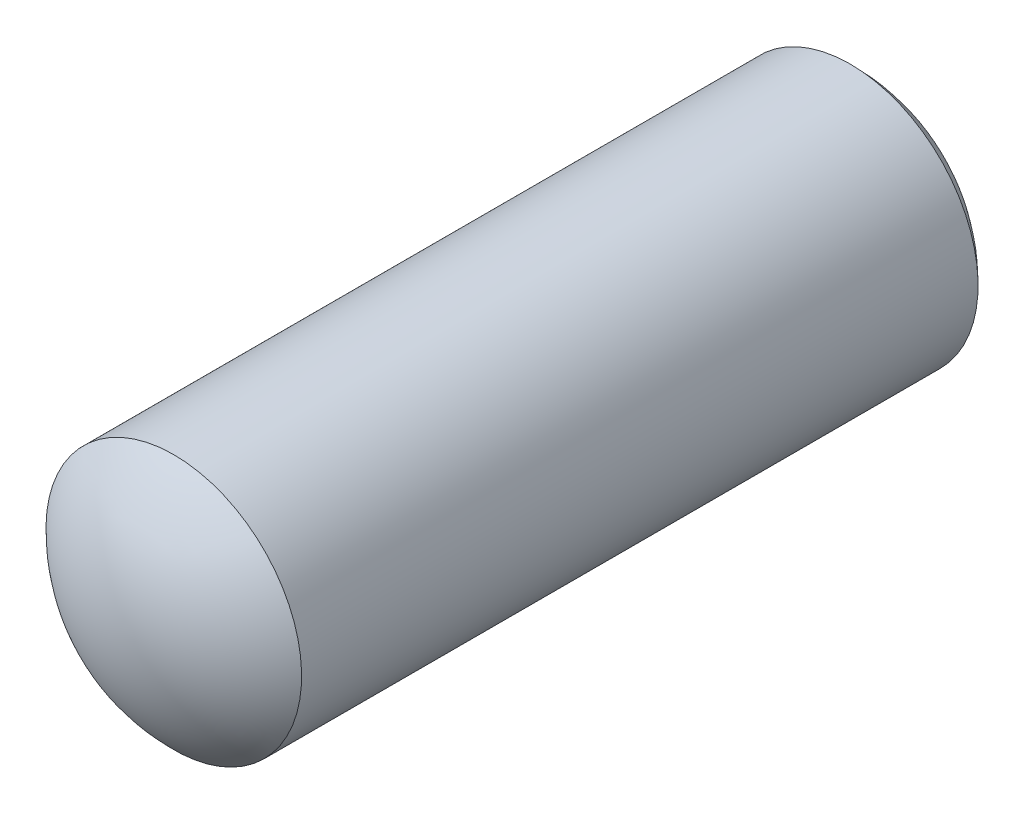
ISO-10303-21;
HEADER;
FILE_DESCRIPTION(('STEP AP214'),'2;1');
FILE_NAME('part.step','',(''),(''),'','','');
FILE_SCHEMA(('AUTOMOTIVE_DESIGN { 1 0 10303 214 1 1 1 1 }'));
ENDSEC;
DATA;
#1=APPLICATION_CONTEXT('core data for automotive mechanical design processes');
#2=APPLICATION_PROTOCOL_DEFINITION('international standard','automotive_design',2000,#1);
#3=PRODUCT_CONTEXT('',#1,'mechanical');
#4=PRODUCT('Part','Part','',(#3));
#5=PRODUCT_RELATED_PRODUCT_CATEGORY('part','',(#4));
#6=PRODUCT_DEFINITION_FORMATION('','',#4);
#7=PRODUCT_DEFINITION_CONTEXT('part definition',#1,'design');
#8=PRODUCT_DEFINITION('design','',#6,#7);
#9=PRODUCT_DEFINITION_SHAPE('','',#8);
#10=(LENGTH_UNIT() NAMED_UNIT(*) SI_UNIT(.MILLI.,.METRE.));
#11=(NAMED_UNIT(*) PLANE_ANGLE_UNIT() SI_UNIT($,.RADIAN.));
#12=(NAMED_UNIT(*) SI_UNIT($,.STERADIAN.) SOLID_ANGLE_UNIT());
#13=UNCERTAINTY_MEASURE_WITH_UNIT(LENGTH_MEASURE(1.E-05),#10,'distance_accuracy_value','');
#14=(GEOMETRIC_REPRESENTATION_CONTEXT(3) GLOBAL_UNCERTAINTY_ASSIGNED_CONTEXT((#13)) GLOBAL_UNIT_ASSIGNED_CONTEXT((#10,
#11,#12)) REPRESENTATION_CONTEXT('',''));
#15=CARTESIAN_POINT('',(0.,0.,0.));
#16=DIRECTION('',(0.,0.,1.));
#17=DIRECTION('',(1.,0.,0.));
#18=AXIS2_PLACEMENT_3D('',#15,#16,#17);
#19=CARTESIAN_POINT('',(8.30039195761002,-3.79066199364219,7.875));
#20=DIRECTION('',(-0.415415013001886,-0.909631995354519,0.));
#21=DIRECTION('',(0.,0.,1.));
#22=AXIS2_PLACEMENT_3D('',#19,#20,#21);
#23=SPHERICAL_SURFACE('',#22,1.575);
#24=CARTESIAN_POINT('',(8.30039195761002,-3.79066199364219,7.875));
#25=DIRECTION('',(0.,0.,1.));
#26=DIRECTION('',(-0.909631995354519,0.415415013001886,0.));
#27=AXIS2_PLACEMENT_3D('',#24,#25,#26);
#28=SPHERICAL_SURFACE('',#27,1.575);
#29=CARTESIAN_POINT('',(8.30039195761002,-3.79066199364219,8.97727038425245));
#30=DIRECTION('',(0.,0.,1.));
#31=DIRECTION('',(-0.909631995354519,0.415415013001886,0.));
#32=AXIS2_PLACEMENT_3D('',#29,#30,#31);
#33=CIRCLE('',#32,1.125);
#34=CARTESIAN_POINT('',(7.27705596283619,-3.32332010401507,8.97727038425245));
#35=VERTEX_POINT('',#34);
#36=EDGE_CURVE('E11',#35,#35,#33,.T.);
#37=ORIENTED_EDGE('',*,*,#36,.T.);
#38=EDGE_LOOP('',(#37));
#39=FACE_BOUND('',#38,.T.);
#40=ADVANCED_FACE('F17',(#39),#28,.T.);
#41=CARTESIAN_POINT('',(8.30039195761004,-3.79066199364219,6.));
#42=DIRECTION('',(0.,0.,1.));
#43=DIRECTION('',(-0.909631995354519,0.415415013001886,0.));
#44=AXIS2_PLACEMENT_3D('',#41,#42,#43);
#45=CYLINDRICAL_SURFACE('',#44,1.125);
#46=CARTESIAN_POINT('',(8.30039195761004,-3.79066199364219,3.02272961574759));
#47=DIRECTION('',(0.,0.,1.));
#48=DIRECTION('',(-0.909631995354519,0.415415013001886,0.));
#49=AXIS2_PLACEMENT_3D('',#46,#47,#48);
#50=CIRCLE('',#49,1.125);
#51=CARTESIAN_POINT('',(7.27705596283621,-3.32332010401507,3.02272961574759));
#52=VERTEX_POINT('',#51);
#53=EDGE_CURVE('E25',#52,#52,#50,.T.);
#54=ORIENTED_EDGE('',*,*,#53,.T.);
#55=EDGE_LOOP('',(#54));
#56=FACE_BOUND('',#55,.T.);
#57=ORIENTED_EDGE('',*,*,#36,.F.);
#58=EDGE_LOOP('',(#57));
#59=FACE_BOUND('',#58,.T.);
#60=ADVANCED_FACE('F39',(#56,#59),#45,.T.);
#61=CARTESIAN_POINT('',(8.30039195761002,-3.79066199364219,4.125));
#62=DIRECTION('',(-0.415415013001886,-0.909631995354519,0.));
#63=DIRECTION('',(0.,0.,-1.));
#64=AXIS2_PLACEMENT_3D('',#61,#62,#63);
#65=SPHERICAL_SURFACE('',#64,1.575);
#66=CARTESIAN_POINT('',(8.30039195761002,-3.79066199364219,4.125));
#67=DIRECTION('',(0.,0.,1.));
#68=DIRECTION('',(-0.909631995354519,0.415415013001886,0.));
#69=AXIS2_PLACEMENT_3D('',#66,#67,#68);
#70=SPHERICAL_SURFACE('',#69,1.575);
#71=ORIENTED_EDGE('',*,*,#53,.F.);
#72=EDGE_LOOP('',(#71));
#73=FACE_BOUND('',#72,.T.);
#74=ADVANCED_FACE('F48',(#73),#70,.T.);
#75=CLOSED_SHELL('',(#40,#60,#74));
#76=MANIFOLD_SOLID_BREP('B1',#75);
#77=ADVANCED_BREP_SHAPE_REPRESENTATION('',(#18,#76),#14);
#78=SHAPE_DEFINITION_REPRESENTATION(#9,#77);
ENDSEC;
END-ISO-10303-21;
